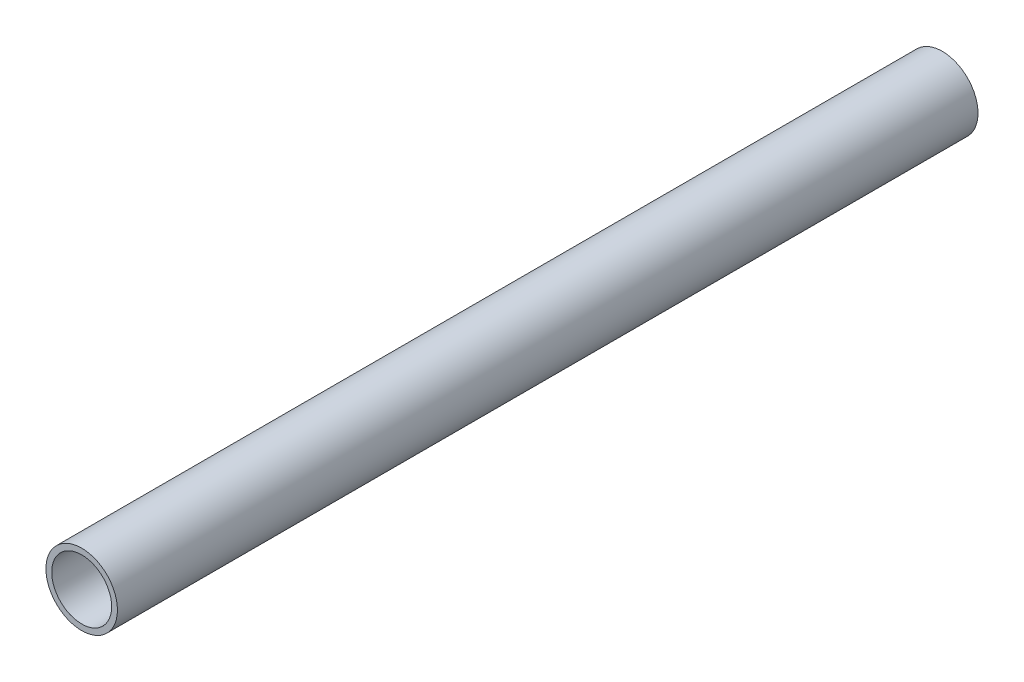
ISO-10303-21;
HEADER;
FILE_DESCRIPTION(('STEP AP214'),'2;1');
FILE_NAME('part.step','',(''),(''),'','','');
FILE_SCHEMA(('AUTOMOTIVE_DESIGN { 1 0 10303 214 1 1 1 1 }'));
ENDSEC;
DATA;
#1=APPLICATION_CONTEXT('core data for automotive mechanical design processes');
#2=APPLICATION_PROTOCOL_DEFINITION('international standard','automotive_design',2000,#1);
#3=PRODUCT_CONTEXT('',#1,'mechanical');
#4=PRODUCT('Part','Part','',(#3));
#5=PRODUCT_RELATED_PRODUCT_CATEGORY('part','',(#4));
#6=PRODUCT_DEFINITION_FORMATION('','',#4);
#7=PRODUCT_DEFINITION_CONTEXT('part definition',#1,'design');
#8=PRODUCT_DEFINITION('design','',#6,#7);
#9=PRODUCT_DEFINITION_SHAPE('','',#8);
#10=(LENGTH_UNIT() NAMED_UNIT(*) SI_UNIT(.MILLI.,.METRE.));
#11=(NAMED_UNIT(*) PLANE_ANGLE_UNIT() SI_UNIT($,.RADIAN.));
#12=(NAMED_UNIT(*) SI_UNIT($,.STERADIAN.) SOLID_ANGLE_UNIT());
#13=UNCERTAINTY_MEASURE_WITH_UNIT(LENGTH_MEASURE(1.E-05),#10,'distance_accuracy_value','');
#14=(GEOMETRIC_REPRESENTATION_CONTEXT(3) GLOBAL_UNCERTAINTY_ASSIGNED_CONTEXT((#13)) GLOBAL_UNIT_ASSIGNED_CONTEXT((#10,
#11,#12)) REPRESENTATION_CONTEXT('',''));
#15=CARTESIAN_POINT('',(0.,0.,0.));
#16=DIRECTION('',(0.,0.,1.));
#17=DIRECTION('',(1.,0.,0.));
#18=AXIS2_PLACEMENT_3D('',#15,#16,#17);
#19=CARTESIAN_POINT('',(0.,0.,-2.));
#20=DIRECTION('',(0.,0.,1.));
#21=DIRECTION('',(1.,0.,0.));
#22=AXIS2_PLACEMENT_3D('',#19,#20,#21);
#23=CYLINDRICAL_SURFACE('',#22,8.35);
#24=CARTESIAN_POINT('',(0.,0.,-2.));
#25=DIRECTION('',(0.,0.,1.));
#26=DIRECTION('',(1.,0.,0.));
#27=AXIS2_PLACEMENT_3D('',#24,#25,#26);
#28=CIRCLE('',#27,8.35);
#29=CARTESIAN_POINT('',(8.35,0.,-2.));
#30=VERTEX_POINT('',#29);
#31=EDGE_CURVE('E10',#30,#30,#28,.T.);
#32=ORIENTED_EDGE('',*,*,#31,.T.);
#33=EDGE_LOOP('',(#32));
#34=FACE_BOUND('',#33,.T.);
#35=CARTESIAN_POINT('',(0.,0.,199.));
#36=DIRECTION('',(0.,0.,1.));
#37=DIRECTION('',(1.,0.,0.));
#38=AXIS2_PLACEMENT_3D('',#35,#36,#37);
#39=CIRCLE('',#38,8.35);
#40=CARTESIAN_POINT('',(8.35,0.,199.));
#41=VERTEX_POINT('',#40);
#42=EDGE_CURVE('E42',#41,#41,#39,.T.);
#43=ORIENTED_EDGE('',*,*,#42,.F.);
#44=EDGE_LOOP('',(#43));
#45=FACE_BOUND('',#44,.T.);
#46=ADVANCED_FACE('F32',(#34,#45),#23,.T.);
#47=CARTESIAN_POINT('',(0.,0.,-2.));
#48=DIRECTION('',(0.,0.,1.));
#49=DIRECTION('',(1.,0.,0.));
#50=AXIS2_PLACEMENT_3D('',#47,#48,#49);
#51=PLANE('',#50);
#52=CARTESIAN_POINT('',(0.,0.,-2.));
#53=DIRECTION('',(0.,0.,1.));
#54=DIRECTION('',(1.,0.,0.));
#55=AXIS2_PLACEMENT_3D('',#52,#53,#54);
#56=CIRCLE('',#55,7.);
#57=CARTESIAN_POINT('',(7.,0.,-2.));
#58=VERTEX_POINT('',#57);
#59=EDGE_CURVE('E38',#58,#58,#56,.T.);
#60=ORIENTED_EDGE('',*,*,#59,.T.);
#61=EDGE_LOOP('',(#60));
#62=FACE_BOUND('',#61,.T.);
#63=ORIENTED_EDGE('',*,*,#31,.F.);
#64=EDGE_LOOP('',(#63));
#65=FACE_BOUND('',#64,.T.);
#66=ADVANCED_FACE('F61',(#62,#65),#51,.F.);
#67=CARTESIAN_POINT('',(0.,0.,-2.));
#68=DIRECTION('',(0.,0.,1.));
#69=DIRECTION('',(1.,0.,0.));
#70=AXIS2_PLACEMENT_3D('',#67,#68,#69);
#71=CYLINDRICAL_SURFACE('',#70,7.);
#72=ORIENTED_EDGE('',*,*,#59,.F.);
#73=EDGE_LOOP('',(#72));
#74=FACE_BOUND('',#73,.T.);
#75=CARTESIAN_POINT('',(0.,0.,199.));
#76=DIRECTION('',(0.,0.,1.));
#77=DIRECTION('',(1.,0.,0.));
#78=AXIS2_PLACEMENT_3D('',#75,#76,#77);
#79=CIRCLE('',#78,7.);
#80=CARTESIAN_POINT('',(7.,0.,199.));
#81=VERTEX_POINT('',#80);
#82=EDGE_CURVE('E46',#81,#81,#79,.T.);
#83=ORIENTED_EDGE('',*,*,#82,.T.);
#84=EDGE_LOOP('',(#83));
#85=FACE_BOUND('',#84,.T.);
#86=ADVANCED_FACE('F52',(#74,#85),#71,.F.);
#87=CARTESIAN_POINT('',(6.05708153854816,-7.94507792506612,199.));
#88=DIRECTION('',(0.,0.,1.));
#89=DIRECTION('',(-0.933719245427782,0.358006104302391,0.));
#90=AXIS2_PLACEMENT_3D('',#87,#88,#89);
#91=PLANE('',#90);
#92=ORIENTED_EDGE('',*,*,#82,.F.);
#93=EDGE_LOOP('',(#92));
#94=FACE_BOUND('',#93,.T.);
#95=ORIENTED_EDGE('',*,*,#42,.T.);
#96=EDGE_LOOP('',(#95));
#97=FACE_BOUND('',#96,.T.);
#98=ADVANCED_FACE('F54',(#94,#97),#91,.T.);
#99=CLOSED_SHELL('',(#46,#66,#86,#98));
#100=MANIFOLD_SOLID_BREP('B2',#99);
#101=ADVANCED_BREP_SHAPE_REPRESENTATION('',(#18,#100),#14);
#102=SHAPE_DEFINITION_REPRESENTATION(#9,#101);
ENDSEC;
END-ISO-10303-21;
